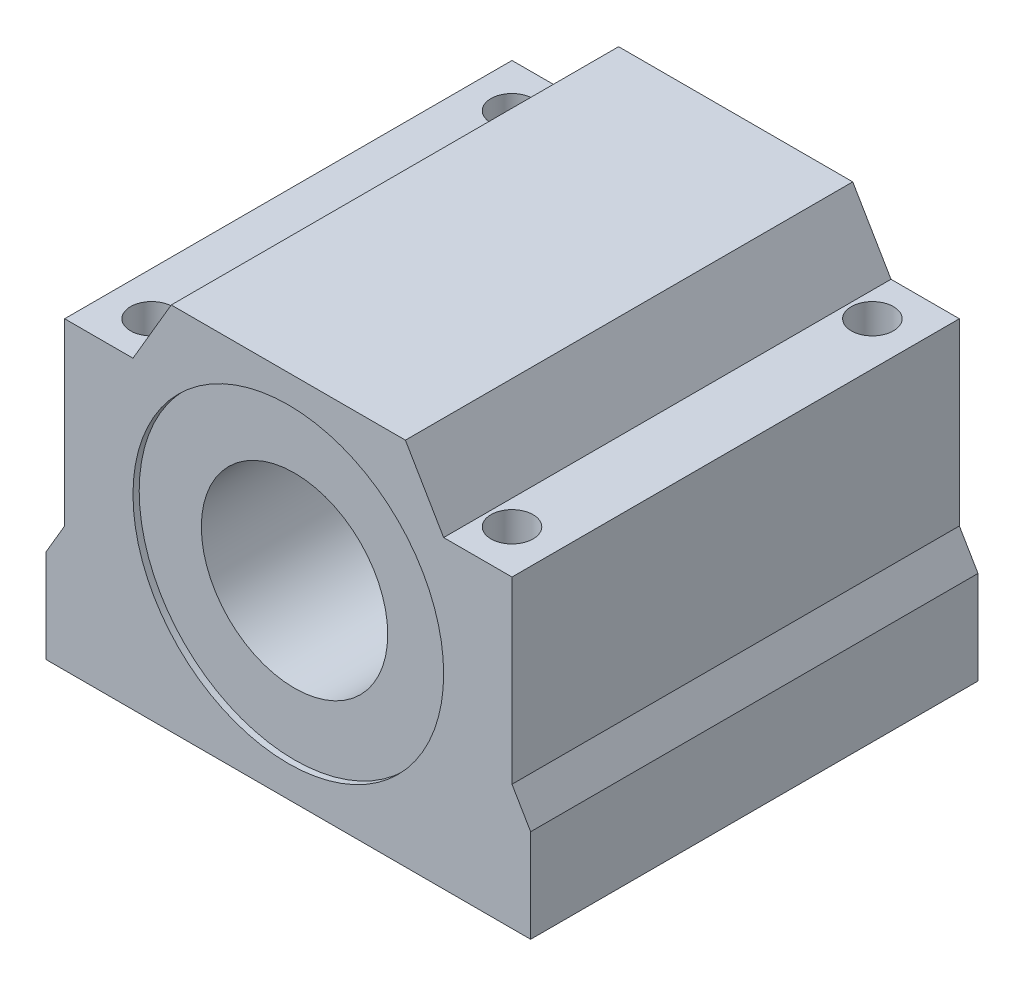
ISO-10303-21;
HEADER;
FILE_DESCRIPTION(('STEP AP214'),'2;1');
FILE_NAME('part.step','',(''),(''),'','','');
FILE_SCHEMA(('AUTOMOTIVE_DESIGN { 1 0 10303 214 1 1 1 1 }'));
ENDSEC;
DATA;
#1=APPLICATION_CONTEXT('core data for automotive mechanical design processes');
#2=APPLICATION_PROTOCOL_DEFINITION('international standard','automotive_design',2000,#1);
#3=PRODUCT_CONTEXT('',#1,'mechanical');
#4=PRODUCT('Part','Part','',(#3));
#5=PRODUCT_RELATED_PRODUCT_CATEGORY('part','',(#4));
#6=PRODUCT_DEFINITION_FORMATION('','',#4);
#7=PRODUCT_DEFINITION_CONTEXT('part definition',#1,'design');
#8=PRODUCT_DEFINITION('design','',#6,#7);
#9=PRODUCT_DEFINITION_SHAPE('','',#8);
#10=(LENGTH_UNIT() NAMED_UNIT(*) SI_UNIT(.MILLI.,.METRE.));
#11=(NAMED_UNIT(*) PLANE_ANGLE_UNIT() SI_UNIT($,.RADIAN.));
#12=(NAMED_UNIT(*) SI_UNIT($,.STERADIAN.) SOLID_ANGLE_UNIT());
#13=UNCERTAINTY_MEASURE_WITH_UNIT(LENGTH_MEASURE(1.E-05),#10,'distance_accuracy_value','');
#14=(GEOMETRIC_REPRESENTATION_CONTEXT(3) GLOBAL_UNCERTAINTY_ASSIGNED_CONTEXT((#13)) GLOBAL_UNIT_ASSIGNED_CONTEXT((#10,
#11,#12)) REPRESENTATION_CONTEXT('',''));
#15=CARTESIAN_POINT('',(0.,0.,0.));
#16=DIRECTION('',(0.,0.,1.));
#17=DIRECTION('',(1.,0.,0.));
#18=AXIS2_PLACEMENT_3D('',#15,#16,#17);
#19=CARTESIAN_POINT('',(0.,29.7500000000005,36.));
#20=DIRECTION('',(0.,0.,1.));
#21=DIRECTION('',(1.,0.,0.));
#22=AXIS2_PLACEMENT_3D('',#19,#20,#21);
#23=PLANE('',#22);
#24=CARTESIAN_POINT('',(0.,30.,36.));
#25=DIRECTION('',(0.,0.,-1.));
#26=DIRECTION('',(1.,0.,0.));
#27=AXIS2_PLACEMENT_3D('',#24,#25,#26);
#28=CIRCLE('',#27,25.);
#29=CARTESIAN_POINT('',(-25.,30.,36.));
#30=VERTEX_POINT('',#29);
#31=EDGE_CURVE('P0_E164',#30,#30,#28,.T.);
#32=ORIENTED_EDGE('',*,*,#31,.T.);
#33=EDGE_LOOP('',(#32));
#34=FACE_BOUND('',#33,.T.);
#35=DIRECTION('',(1.,0.,0.));
#36=VECTOR('',#35,1.);
#37=CARTESIAN_POINT('',(0.,0.,36.));
#38=LINE('',#37,#36);
#39=CARTESIAN_POINT('',(-39.,0.,36.));
#40=VERTEX_POINT('',#39);
#41=CARTESIAN_POINT('',(39.,0.,36.));
#42=VERTEX_POINT('',#41);
#43=EDGE_CURVE('P0_E11',#40,#42,#38,.T.);
#44=ORIENTED_EDGE('',*,*,#43,.T.);
#45=DIRECTION('',(0.,1.,0.));
#46=VECTOR('',#45,1.);
#47=CARTESIAN_POINT('',(39.,0.,36.));
#48=LINE('',#47,#46);
#49=CARTESIAN_POINT('',(39.,15.,36.));
#50=VERTEX_POINT('',#49);
#51=EDGE_CURVE('P0_E259',#42,#50,#48,.T.);
#52=ORIENTED_EDGE('',*,*,#51,.T.);
#53=DIRECTION('',(-0.505858736644665,0.862616333348879,0.));
#54=VECTOR('',#53,1.);
#55=CARTESIAN_POINT('',(36.,20.1157542858934,36.));
#56=LINE('',#55,#54);
#57=CARTESIAN_POINT('',(36.,20.1157542858934,36.));
#58=VERTEX_POINT('',#57);
#59=EDGE_CURVE('P0_E194',#50,#58,#56,.T.);
#60=ORIENTED_EDGE('',*,*,#59,.T.);
#61=DIRECTION('',(0.,1.,0.));
#62=VECTOR('',#61,1.);
#63=CARTESIAN_POINT('',(36.,20.1157542858934,36.));
#64=LINE('',#63,#62);
#65=CARTESIAN_POINT('',(36.,49.,36.));
#66=VERTEX_POINT('',#65);
#67=EDGE_CURVE('P0_E195',#58,#66,#64,.T.);
#68=ORIENTED_EDGE('',*,*,#67,.T.);
#69=DIRECTION('',(-1.,0.,0.));
#70=VECTOR('',#69,1.);
#71=CARTESIAN_POINT('',(36.,49.,36.));
#72=LINE('',#71,#70);
#73=CARTESIAN_POINT('',(25.,49.,36.));
#74=VERTEX_POINT('',#73);
#75=EDGE_CURVE('P0_E288',#66,#74,#72,.T.);
#76=ORIENTED_EDGE('',*,*,#75,.T.);
#77=DIRECTION('',(-0.505858736644659,0.862616333348882,0.));
#78=VECTOR('',#77,1.);
#79=CARTESIAN_POINT('',(18.8425502399788,59.5000000000011,36.));
#80=LINE('',#79,#78);
#81=CARTESIAN_POINT('',(18.8425502399788,59.5,36.));
#82=VERTEX_POINT('',#81);
#83=EDGE_CURVE('P0_E254',#74,#82,#80,.T.);
#84=ORIENTED_EDGE('',*,*,#83,.T.);
#85=DIRECTION('',(-1.,0.,0.));
#86=VECTOR('',#85,1.);
#87=CARTESIAN_POINT('',(0.,59.5,36.));
#88=LINE('',#87,#86);
#89=CARTESIAN_POINT('',(-18.8425502399788,59.5000000000009,36.));
#90=VERTEX_POINT('',#89);
#91=EDGE_CURVE('P0_E186',#82,#90,#88,.T.);
#92=ORIENTED_EDGE('',*,*,#91,.T.);
#93=DIRECTION('',(-0.505858736644664,-0.862616333348879,0.));
#94=VECTOR('',#93,1.);
#95=CARTESIAN_POINT('',(-25.,49.,36.));
#96=LINE('',#95,#94);
#97=CARTESIAN_POINT('',(-25.,49.,36.));
#98=VERTEX_POINT('',#97);
#99=EDGE_CURVE('P0_E241',#90,#98,#96,.T.);
#100=ORIENTED_EDGE('',*,*,#99,.T.);
#101=DIRECTION('',(-1.,0.,0.));
#102=VECTOR('',#101,1.);
#103=CARTESIAN_POINT('',(-36.,49.,36.));
#104=LINE('',#103,#102);
#105=CARTESIAN_POINT('',(-36.,49.,36.));
#106=VERTEX_POINT('',#105);
#107=EDGE_CURVE('P0_E263',#98,#106,#104,.T.);
#108=ORIENTED_EDGE('',*,*,#107,.T.);
#109=DIRECTION('',(0.,-1.,0.));
#110=VECTOR('',#109,1.);
#111=CARTESIAN_POINT('',(-36.,20.1157542858934,36.));
#112=LINE('',#111,#110);
#113=CARTESIAN_POINT('',(-36.,20.1157542858934,36.));
#114=VERTEX_POINT('',#113);
#115=EDGE_CURVE('P0_E205',#106,#114,#112,.T.);
#116=ORIENTED_EDGE('',*,*,#115,.T.);
#117=DIRECTION('',(-0.505858736644665,-0.862616333348879,0.));
#118=VECTOR('',#117,1.);
#119=CARTESIAN_POINT('',(-39.,15.,36.));
#120=LINE('',#119,#118);
#121=CARTESIAN_POINT('',(-39.,15.,36.));
#122=VERTEX_POINT('',#121);
#123=EDGE_CURVE('P0_E206',#114,#122,#120,.T.);
#124=ORIENTED_EDGE('',*,*,#123,.T.);
#125=DIRECTION('',(0.,-1.,0.));
#126=VECTOR('',#125,1.);
#127=CARTESIAN_POINT('',(-39.,0.,36.));
#128=LINE('',#127,#126);
#129=EDGE_CURVE('P0_E227',#122,#40,#128,.T.);
#130=ORIENTED_EDGE('',*,*,#129,.T.);
#131=EDGE_LOOP('',(#44,#52,#60,#68,#76,#84,#92,#100,#108,#116,#124,#130));
#132=FACE_BOUND('',#131,.T.);
#133=ADVANCED_FACE('P0_F16',(#34,#132),#23,.T.);
#134=CARTESIAN_POINT('',(-39.,0.,0.));
#135=DIRECTION('',(0.,-1.,0.));
#136=DIRECTION('',(0.,0.,-1.));
#137=AXIS2_PLACEMENT_3D('',#134,#135,#136);
#138=PLANE('',#137);
#139=CARTESIAN_POINT('',(-29.,0.,-29.));
#140=DIRECTION('',(0.,1.,0.));
#141=DIRECTION('',(0.,0.,-1.));
#142=AXIS2_PLACEMENT_3D('',#139,#140,#141);
#143=CIRCLE('',#142,3.38975);
#144=CARTESIAN_POINT('',(-29.,0.,-25.61025));
#145=VERTEX_POINT('',#144);
#146=EDGE_CURVE('P0_E301',#145,#145,#143,.T.);
#147=ORIENTED_EDGE('',*,*,#146,.T.);
#148=EDGE_LOOP('',(#147));
#149=FACE_BOUND('',#148,.T.);
#150=CARTESIAN_POINT('',(29.,0.,29.));
#151=DIRECTION('',(0.,1.,0.));
#152=DIRECTION('',(0.,0.,-1.));
#153=AXIS2_PLACEMENT_3D('',#150,#151,#152);
#154=CIRCLE('',#153,3.38975);
#155=CARTESIAN_POINT('',(29.,0.,32.38975));
#156=VERTEX_POINT('',#155);
#157=EDGE_CURVE('P0_E253',#156,#156,#154,.T.);
#158=ORIENTED_EDGE('',*,*,#157,.T.);
#159=EDGE_LOOP('',(#158));
#160=FACE_BOUND('',#159,.T.);
#161=CARTESIAN_POINT('',(-29.,0.,29.));
#162=DIRECTION('',(0.,1.,0.));
#163=DIRECTION('',(0.,0.,-1.));
#164=AXIS2_PLACEMENT_3D('',#161,#162,#163);
#165=CIRCLE('',#164,3.38975);
#166=CARTESIAN_POINT('',(-29.,0.,32.38975));
#167=VERTEX_POINT('',#166);
#168=EDGE_CURVE('P0_E280',#167,#167,#165,.T.);
#169=ORIENTED_EDGE('',*,*,#168,.T.);
#170=EDGE_LOOP('',(#169));
#171=FACE_BOUND('',#170,.T.);
#172=CARTESIAN_POINT('',(29.,0.,-29.));
#173=DIRECTION('',(0.,1.,0.));
#174=DIRECTION('',(0.,0.,-1.));
#175=AXIS2_PLACEMENT_3D('',#172,#173,#174);
#176=CIRCLE('',#175,3.38975);
#177=CARTESIAN_POINT('',(29.,0.,-25.61025));
#178=VERTEX_POINT('',#177);
#179=EDGE_CURVE('P0_E238',#178,#178,#176,.T.);
#180=ORIENTED_EDGE('',*,*,#179,.T.);
#181=EDGE_LOOP('',(#180));
#182=FACE_BOUND('',#181,.T.);
#183=DIRECTION('',(0.,0.,1.));
#184=VECTOR('',#183,1.);
#185=CARTESIAN_POINT('',(39.,0.,0.));
#186=LINE('',#185,#184);
#187=CARTESIAN_POINT('',(39.,0.,-36.));
#188=VERTEX_POINT('',#187);
#189=EDGE_CURVE('P0_E27',#188,#42,#186,.T.);
#190=ORIENTED_EDGE('',*,*,#189,.T.);
#191=ORIENTED_EDGE('',*,*,#43,.F.);
#192=DIRECTION('',(0.,0.,1.));
#193=VECTOR('',#192,1.);
#194=CARTESIAN_POINT('',(-39.,0.,0.));
#195=LINE('',#194,#193);
#196=CARTESIAN_POINT('',(-39.,0.,-36.));
#197=VERTEX_POINT('',#196);
#198=EDGE_CURVE('P0_E166',#197,#40,#195,.T.);
#199=ORIENTED_EDGE('',*,*,#198,.F.);
#200=DIRECTION('',(-1.,0.,0.));
#201=VECTOR('',#200,1.);
#202=CARTESIAN_POINT('',(0.,0.,-36.));
#203=LINE('',#202,#201);
#204=EDGE_CURVE('P0_E271',#188,#197,#203,.T.);
#205=ORIENTED_EDGE('',*,*,#204,.F.);
#206=EDGE_LOOP('',(#190,#191,#199,#205));
#207=FACE_BOUND('',#206,.T.);
#208=ADVANCED_FACE('P0_F359',(#149,#160,#171,#182,#207),#138,.T.);
#209=CARTESIAN_POINT('',(39.,0.,0.));
#210=DIRECTION('',(1.,0.,0.));
#211=DIRECTION('',(0.,1.,0.));
#212=AXIS2_PLACEMENT_3D('',#209,#210,#211);
#213=PLANE('',#212);
#214=DIRECTION('',(0.,0.,1.));
#215=VECTOR('',#214,1.);
#216=CARTESIAN_POINT('',(39.,15.,0.));
#217=LINE('',#216,#215);
#218=CARTESIAN_POINT('',(39.,15.,-36.));
#219=VERTEX_POINT('',#218);
#220=EDGE_CURVE('P0_E308',#219,#50,#217,.T.);
#221=ORIENTED_EDGE('',*,*,#220,.T.);
#222=ORIENTED_EDGE('',*,*,#51,.F.);
#223=ORIENTED_EDGE('',*,*,#189,.F.);
#224=DIRECTION('',(0.,-1.,0.));
#225=VECTOR('',#224,1.);
#226=CARTESIAN_POINT('',(39.,0.,-36.));
#227=LINE('',#226,#225);
#228=EDGE_CURVE('P0_E171',#219,#188,#227,.T.);
#229=ORIENTED_EDGE('',*,*,#228,.F.);
#230=EDGE_LOOP('',(#221,#222,#223,#229));
#231=FACE_BOUND('',#230,.T.);
#232=ADVANCED_FACE('P0_F365',(#231),#213,.T.);
#233=CARTESIAN_POINT('',(39.,15.,0.));
#234=DIRECTION('',(0.862616333348879,0.505858736644664,0.));
#235=DIRECTION('',(0.,0.,-1.));
#236=AXIS2_PLACEMENT_3D('',#233,#234,#235);
#237=PLANE('',#236);
#238=DIRECTION('',(0.,0.,1.));
#239=VECTOR('',#238,1.);
#240=CARTESIAN_POINT('',(36.,20.1157542858934,0.));
#241=LINE('',#240,#239);
#242=CARTESIAN_POINT('',(36.,20.1157542858934,-36.));
#243=VERTEX_POINT('',#242);
#244=EDGE_CURVE('P0_E191',#243,#58,#241,.T.);
#245=ORIENTED_EDGE('',*,*,#244,.T.);
#246=ORIENTED_EDGE('',*,*,#59,.F.);
#247=ORIENTED_EDGE('',*,*,#220,.F.);
#248=DIRECTION('',(0.505858736644665,-0.862616333348879,0.));
#249=VECTOR('',#248,1.);
#250=CARTESIAN_POINT('',(36.,20.1157542858934,-36.));
#251=LINE('',#250,#249);
#252=EDGE_CURVE('P0_E180',#243,#219,#251,.T.);
#253=ORIENTED_EDGE('',*,*,#252,.F.);
#254=EDGE_LOOP('',(#245,#246,#247,#253));
#255=FACE_BOUND('',#254,.T.);
#256=ADVANCED_FACE('P0_F352',(#255),#237,.T.);
#257=CARTESIAN_POINT('',(36.,20.1157542858934,0.));
#258=DIRECTION('',(1.,0.,0.));
#259=DIRECTION('',(0.,-1.,0.));
#260=AXIS2_PLACEMENT_3D('',#257,#258,#259);
#261=PLANE('',#260);
#262=DIRECTION('',(0.,0.,1.));
#263=VECTOR('',#262,1.);
#264=CARTESIAN_POINT('',(36.,49.,0.));
#265=LINE('',#264,#263);
#266=CARTESIAN_POINT('',(36.,49.,-36.));
#267=VERTEX_POINT('',#266);
#268=EDGE_CURVE('P0_E20',#267,#66,#265,.T.);
#269=ORIENTED_EDGE('',*,*,#268,.T.);
#270=ORIENTED_EDGE('',*,*,#67,.F.);
#271=ORIENTED_EDGE('',*,*,#244,.F.);
#272=DIRECTION('',(0.,-1.,0.));
#273=VECTOR('',#272,1.);
#274=CARTESIAN_POINT('',(36.,20.1157542858934,-36.));
#275=LINE('',#274,#273);
#276=EDGE_CURVE('P0_E243',#267,#243,#275,.T.);
#277=ORIENTED_EDGE('',*,*,#276,.F.);
#278=EDGE_LOOP('',(#269,#270,#271,#277));
#279=FACE_BOUND('',#278,.T.);
#280=ADVANCED_FACE('P0_F343',(#279),#261,.T.);
#281=CARTESIAN_POINT('',(36.,49.,0.));
#282=DIRECTION('',(0.,1.,0.));
#283=DIRECTION('',(1.,0.,0.));
#284=AXIS2_PLACEMENT_3D('',#281,#282,#283);
#285=PLANE('',#284);
#286=CARTESIAN_POINT('',(29.,49.,29.));
#287=DIRECTION('',(0.,-1.,0.));
#288=DIRECTION('',(0.,0.,-1.));
#289=AXIS2_PLACEMENT_3D('',#286,#287,#288);
#290=CIRCLE('',#289,3.38975);
#291=CARTESIAN_POINT('',(29.,49.,32.38975));
#292=VERTEX_POINT('',#291);
#293=EDGE_CURVE('P0_E252',#292,#292,#290,.T.);
#294=ORIENTED_EDGE('',*,*,#293,.T.);
#295=EDGE_LOOP('',(#294));
#296=FACE_BOUND('',#295,.T.);
#297=CARTESIAN_POINT('',(29.,49.,-29.));
#298=DIRECTION('',(0.,-1.,0.));
#299=DIRECTION('',(0.,0.,-1.));
#300=AXIS2_PLACEMENT_3D('',#297,#298,#299);
#301=CIRCLE('',#300,3.38975);
#302=CARTESIAN_POINT('',(29.,49.,-25.61025));
#303=VERTEX_POINT('',#302);
#304=EDGE_CURVE('P0_E237',#303,#303,#301,.T.);
#305=ORIENTED_EDGE('',*,*,#304,.T.);
#306=EDGE_LOOP('',(#305));
#307=FACE_BOUND('',#306,.T.);
#308=DIRECTION('',(0.,0.,1.));
#309=VECTOR('',#308,1.);
#310=CARTESIAN_POINT('',(25.,49.,0.));
#311=LINE('',#310,#309);
#312=CARTESIAN_POINT('',(25.,49.,-36.));
#313=VERTEX_POINT('',#312);
#314=EDGE_CURVE('P0_E115',#313,#74,#311,.T.);
#315=ORIENTED_EDGE('',*,*,#314,.T.);
#316=ORIENTED_EDGE('',*,*,#75,.F.);
#317=ORIENTED_EDGE('',*,*,#268,.F.);
#318=DIRECTION('',(1.,0.,0.));
#319=VECTOR('',#318,1.);
#320=CARTESIAN_POINT('',(36.,49.,-36.));
#321=LINE('',#320,#319);
#322=EDGE_CURVE('P0_E246',#313,#267,#321,.T.);
#323=ORIENTED_EDGE('',*,*,#322,.F.);
#324=EDGE_LOOP('',(#315,#316,#317,#323));
#325=FACE_BOUND('',#324,.T.);
#326=ADVANCED_FACE('P0_F341',(#296,#307,#325),#285,.T.);
#327=CARTESIAN_POINT('',(25.,49.,0.));
#328=DIRECTION('',(0.862616333348882,0.505858736644659,0.));
#329=DIRECTION('',(0.,0.,-1.));
#330=AXIS2_PLACEMENT_3D('',#327,#328,#329);
#331=PLANE('',#330);
#332=DIRECTION('',(0.,0.,1.));
#333=VECTOR('',#332,1.);
#334=CARTESIAN_POINT('',(18.8425502399788,59.5,0.));
#335=LINE('',#334,#333);
#336=CARTESIAN_POINT('',(18.8425502399788,59.5,-36.));
#337=VERTEX_POINT('',#336);
#338=EDGE_CURVE('P0_E189',#337,#82,#335,.T.);
#339=ORIENTED_EDGE('',*,*,#338,.T.);
#340=ORIENTED_EDGE('',*,*,#83,.F.);
#341=ORIENTED_EDGE('',*,*,#314,.F.);
#342=DIRECTION('',(0.505858736644659,-0.862616333348882,0.));
#343=VECTOR('',#342,1.);
#344=CARTESIAN_POINT('',(18.8425502399788,59.5000000000011,-36.));
#345=LINE('',#344,#343);
#346=EDGE_CURVE('P0_E184',#337,#313,#345,.T.);
#347=ORIENTED_EDGE('',*,*,#346,.F.);
#348=EDGE_LOOP('',(#339,#340,#341,#347));
#349=FACE_BOUND('',#348,.T.);
#350=ADVANCED_FACE('P0_F330',(#349),#331,.T.);
#351=CARTESIAN_POINT('',(18.8425502399788,59.5,0.));
#352=DIRECTION('',(0.,1.,0.));
#353=DIRECTION('',(1.,0.,0.));
#354=AXIS2_PLACEMENT_3D('',#351,#352,#353);
#355=PLANE('',#354);
#356=DIRECTION('',(0.,0.,1.));
#357=VECTOR('',#356,1.);
#358=CARTESIAN_POINT('',(-18.8425502399788,59.5000000000009,0.));
#359=LINE('',#358,#357);
#360=CARTESIAN_POINT('',(-18.8425502399788,59.5000000000009,-36.));
#361=VERTEX_POINT('',#360);
#362=EDGE_CURVE('P0_E190',#361,#90,#359,.T.);
#363=ORIENTED_EDGE('',*,*,#362,.T.);
#364=ORIENTED_EDGE('',*,*,#91,.F.);
#365=ORIENTED_EDGE('',*,*,#338,.F.);
#366=DIRECTION('',(1.,0.,0.));
#367=VECTOR('',#366,1.);
#368=CARTESIAN_POINT('',(0.,59.5,-36.));
#369=LINE('',#368,#367);
#370=EDGE_CURVE('P0_E292',#361,#337,#369,.T.);
#371=ORIENTED_EDGE('',*,*,#370,.F.);
#372=EDGE_LOOP('',(#363,#364,#365,#371));
#373=FACE_BOUND('',#372,.T.);
#374=ADVANCED_FACE('P0_F335',(#373),#355,.T.);
#375=CARTESIAN_POINT('',(-18.8425502399788,59.5000000000009,0.));
#376=DIRECTION('',(-0.862616333348879,0.505858736644664,0.));
#377=DIRECTION('',(0.,0.,1.));
#378=AXIS2_PLACEMENT_3D('',#375,#376,#377);
#379=PLANE('',#378);
#380=DIRECTION('',(0.,0.,1.));
#381=VECTOR('',#380,1.);
#382=CARTESIAN_POINT('',(-25.,49.,0.));
#383=LINE('',#382,#381);
#384=CARTESIAN_POINT('',(-25.,49.,-36.));
#385=VERTEX_POINT('',#384);
#386=EDGE_CURVE('P0_E264',#385,#98,#383,.T.);
#387=ORIENTED_EDGE('',*,*,#386,.T.);
#388=ORIENTED_EDGE('',*,*,#99,.F.);
#389=ORIENTED_EDGE('',*,*,#362,.F.);
#390=DIRECTION('',(0.505858736644664,0.862616333348879,0.));
#391=VECTOR('',#390,1.);
#392=CARTESIAN_POINT('',(-25.,49.,-36.));
#393=LINE('',#392,#391);
#394=EDGE_CURVE('P0_E231',#385,#361,#393,.T.);
#395=ORIENTED_EDGE('',*,*,#394,.F.);
#396=EDGE_LOOP('',(#387,#388,#389,#395));
#397=FACE_BOUND('',#396,.T.);
#398=ADVANCED_FACE('P0_F381',(#397),#379,.T.);
#399=CARTESIAN_POINT('',(-25.,49.,0.));
#400=DIRECTION('',(0.,1.,0.));
#401=DIRECTION('',(1.,0.,0.));
#402=AXIS2_PLACEMENT_3D('',#399,#400,#401);
#403=PLANE('',#402);
#404=CARTESIAN_POINT('',(-29.,49.,-29.));
#405=DIRECTION('',(0.,-1.,0.));
#406=DIRECTION('',(0.,0.,-1.));
#407=AXIS2_PLACEMENT_3D('',#404,#405,#406);
#408=CIRCLE('',#407,3.38975);
#409=CARTESIAN_POINT('',(-29.,49.,-25.61025));
#410=VERTEX_POINT('',#409);
#411=EDGE_CURVE('P0_E300',#410,#410,#408,.T.);
#412=ORIENTED_EDGE('',*,*,#411,.T.);
#413=EDGE_LOOP('',(#412));
#414=FACE_BOUND('',#413,.T.);
#415=CARTESIAN_POINT('',(-29.,49.,29.));
#416=DIRECTION('',(0.,-1.,0.));
#417=DIRECTION('',(0.,0.,-1.));
#418=AXIS2_PLACEMENT_3D('',#415,#416,#417);
#419=CIRCLE('',#418,3.38975);
#420=CARTESIAN_POINT('',(-29.,49.,32.38975));
#421=VERTEX_POINT('',#420);
#422=EDGE_CURVE('P0_E279',#421,#421,#419,.T.);
#423=ORIENTED_EDGE('',*,*,#422,.T.);
#424=EDGE_LOOP('',(#423));
#425=FACE_BOUND('',#424,.T.);
#426=DIRECTION('',(0.,0.,1.));
#427=VECTOR('',#426,1.);
#428=CARTESIAN_POINT('',(-36.,49.,0.));
#429=LINE('',#428,#427);
#430=CARTESIAN_POINT('',(-36.,49.,-36.));
#431=VERTEX_POINT('',#430);
#432=EDGE_CURVE('P0_E218',#431,#106,#429,.T.);
#433=ORIENTED_EDGE('',*,*,#432,.T.);
#434=ORIENTED_EDGE('',*,*,#107,.F.);
#435=ORIENTED_EDGE('',*,*,#386,.F.);
#436=DIRECTION('',(1.,0.,0.));
#437=VECTOR('',#436,1.);
#438=CARTESIAN_POINT('',(-36.,49.,-36.));
#439=LINE('',#438,#437);
#440=EDGE_CURVE('P0_E514',#431,#385,#439,.T.);
#441=ORIENTED_EDGE('',*,*,#440,.F.);
#442=EDGE_LOOP('',(#433,#434,#435,#441));
#443=FACE_BOUND('',#442,.T.);
#444=ADVANCED_FACE('P0_F372',(#414,#425,#443),#403,.T.);
#445=CARTESIAN_POINT('',(-36.,49.,0.));
#446=DIRECTION('',(-1.,0.,0.));
#447=DIRECTION('',(0.,1.,0.));
#448=AXIS2_PLACEMENT_3D('',#445,#446,#447);
#449=PLANE('',#448);
#450=DIRECTION('',(0.,0.,1.));
#451=VECTOR('',#450,1.);
#452=CARTESIAN_POINT('',(-36.,20.1157542858934,0.));
#453=LINE('',#452,#451);
#454=CARTESIAN_POINT('',(-36.,20.1157542858934,-36.));
#455=VERTEX_POINT('',#454);
#456=EDGE_CURVE('P0_E202',#455,#114,#453,.T.);
#457=ORIENTED_EDGE('',*,*,#456,.T.);
#458=ORIENTED_EDGE('',*,*,#115,.F.);
#459=ORIENTED_EDGE('',*,*,#432,.F.);
#460=DIRECTION('',(0.,1.,0.));
#461=VECTOR('',#460,1.);
#462=CARTESIAN_POINT('',(-36.,20.1157542858934,-36.));
#463=LINE('',#462,#461);
#464=EDGE_CURVE('P0_E200',#455,#431,#463,.T.);
#465=ORIENTED_EDGE('',*,*,#464,.F.);
#466=EDGE_LOOP('',(#457,#458,#459,#465));
#467=FACE_BOUND('',#466,.T.);
#468=ADVANCED_FACE('P0_F368',(#467),#449,.T.);
#469=CARTESIAN_POINT('',(-36.,20.1157542858934,0.));
#470=DIRECTION('',(-0.862616333348879,0.505858736644665,0.));
#471=DIRECTION('',(0.,0.,1.));
#472=AXIS2_PLACEMENT_3D('',#469,#470,#471);
#473=PLANE('',#472);
#474=DIRECTION('',(0.,0.,1.));
#475=VECTOR('',#474,1.);
#476=CARTESIAN_POINT('',(-39.,15.,0.));
#477=LINE('',#476,#475);
#478=CARTESIAN_POINT('',(-39.,15.,-36.));
#479=VERTEX_POINT('',#478);
#480=EDGE_CURVE('P0_E221',#479,#122,#477,.T.);
#481=ORIENTED_EDGE('',*,*,#480,.T.);
#482=ORIENTED_EDGE('',*,*,#123,.F.);
#483=ORIENTED_EDGE('',*,*,#456,.F.);
#484=DIRECTION('',(0.505858736644665,0.862616333348879,0.));
#485=VECTOR('',#484,1.);
#486=CARTESIAN_POINT('',(-39.,15.,-36.));
#487=LINE('',#486,#485);
#488=EDGE_CURVE('P0_E197',#479,#455,#487,.T.);
#489=ORIENTED_EDGE('',*,*,#488,.F.);
#490=EDGE_LOOP('',(#481,#482,#483,#489));
#491=FACE_BOUND('',#490,.T.);
#492=ADVANCED_FACE('P0_F371',(#491),#473,.T.);
#493=CARTESIAN_POINT('',(-39.,15.,0.));
#494=DIRECTION('',(-1.,0.,0.));
#495=DIRECTION('',(0.,0.,1.));
#496=AXIS2_PLACEMENT_3D('',#493,#494,#495);
#497=PLANE('',#496);
#498=ORIENTED_EDGE('',*,*,#198,.T.);
#499=ORIENTED_EDGE('',*,*,#129,.F.);
#500=ORIENTED_EDGE('',*,*,#480,.F.);
#501=DIRECTION('',(0.,1.,0.));
#502=VECTOR('',#501,1.);
#503=CARTESIAN_POINT('',(-39.,0.,-36.));
#504=LINE('',#503,#502);
#505=EDGE_CURVE('P0_E201',#197,#479,#504,.T.);
#506=ORIENTED_EDGE('',*,*,#505,.F.);
#507=EDGE_LOOP('',(#498,#499,#500,#506));
#508=FACE_BOUND('',#507,.T.);
#509=ADVANCED_FACE('P0_F389',(#508),#497,.T.);
#510=CARTESIAN_POINT('',(0.,30.,0.));
#511=DIRECTION('',(0.,0.,1.));
#512=DIRECTION('',(1.,0.,0.));
#513=AXIS2_PLACEMENT_3D('',#510,#511,#512);
#514=CYLINDRICAL_SURFACE('',#513,25.);
#515=ORIENTED_EDGE('',*,*,#31,.F.);
#516=DIRECTION('',(0.,0.,-1.));
#517=VECTOR('',#516,1.);
#518=CARTESIAN_POINT('',(-25.,30.,0.));
#519=LINE('',#518,#517);
#520=CARTESIAN_POINT('',(-25.,30.,-36.));
#521=VERTEX_POINT('',#520);
#522=EDGE_CURVE('P0_E159',#30,#521,#519,.T.);
#523=ORIENTED_EDGE('',*,*,#522,.T.);
#524=CARTESIAN_POINT('',(0.,30.,-36.));
#525=DIRECTION('',(0.,0.,1.));
#526=DIRECTION('',(1.,0.,0.));
#527=AXIS2_PLACEMENT_3D('',#524,#525,#526);
#528=CIRCLE('',#527,25.);
#529=EDGE_CURVE('P0_E162',#521,#521,#528,.T.);
#530=ORIENTED_EDGE('',*,*,#529,.F.);
#531=ORIENTED_EDGE('',*,*,#522,.F.);
#532=EDGE_LOOP('',(#515,#523,#530,#531));
#533=FACE_BOUND('',#532,.T.);
#534=ADVANCED_FACE('P0_F161',(#533),#514,.F.);
#535=CARTESIAN_POINT('',(0.,29.7500000000005,-36.));
#536=DIRECTION('',(0.,0.,1.));
#537=DIRECTION('',(1.,0.,0.));
#538=AXIS2_PLACEMENT_3D('',#535,#536,#537);
#539=PLANE('',#538);
#540=ORIENTED_EDGE('',*,*,#529,.T.);
#541=EDGE_LOOP('',(#540));
#542=FACE_BOUND('',#541,.T.);
#543=ORIENTED_EDGE('',*,*,#204,.T.);
#544=ORIENTED_EDGE('',*,*,#505,.T.);
#545=ORIENTED_EDGE('',*,*,#488,.T.);
#546=ORIENTED_EDGE('',*,*,#464,.T.);
#547=ORIENTED_EDGE('',*,*,#440,.T.);
#548=ORIENTED_EDGE('',*,*,#394,.T.);
#549=ORIENTED_EDGE('',*,*,#370,.T.);
#550=ORIENTED_EDGE('',*,*,#346,.T.);
#551=ORIENTED_EDGE('',*,*,#322,.T.);
#552=ORIENTED_EDGE('',*,*,#276,.T.);
#553=ORIENTED_EDGE('',*,*,#252,.T.);
#554=ORIENTED_EDGE('',*,*,#228,.T.);
#555=EDGE_LOOP('',(#543,#544,#545,#546,#547,#548,#549,#550,#551,#552,#553,#554));
#556=FACE_BOUND('',#555,.T.);
#557=ADVANCED_FACE('P0_F18',(#542,#556),#539,.F.);
#558=CARTESIAN_POINT('',(-29.,26.95,-29.));
#559=DIRECTION('',(0.,1.,0.));
#560=DIRECTION('',(0.,0.,-1.));
#561=AXIS2_PLACEMENT_3D('',#558,#559,#560);
#562=CYLINDRICAL_SURFACE('',#561,3.38975);
#563=ORIENTED_EDGE('',*,*,#146,.F.);
#564=DIRECTION('',(0.,1.,0.));
#565=VECTOR('',#564,1.);
#566=CARTESIAN_POINT('',(-29.,26.95,-25.61025));
#567=LINE('',#566,#565);
#568=EDGE_CURVE('P0_E296',#145,#410,#567,.T.);
#569=ORIENTED_EDGE('',*,*,#568,.T.);
#570=ORIENTED_EDGE('',*,*,#411,.F.);
#571=ORIENTED_EDGE('',*,*,#568,.F.);
#572=EDGE_LOOP('',(#563,#569,#570,#571));
#573=FACE_BOUND('',#572,.T.);
#574=ADVANCED_FACE('P0_F377',(#573),#562,.F.);
#575=CARTESIAN_POINT('',(29.,26.95,29.));
#576=DIRECTION('',(0.,1.,0.));
#577=DIRECTION('',(0.,0.,-1.));
#578=AXIS2_PLACEMENT_3D('',#575,#576,#577);
#579=CYLINDRICAL_SURFACE('',#578,3.38975);
#580=ORIENTED_EDGE('',*,*,#157,.F.);
#581=DIRECTION('',(0.,1.,0.));
#582=VECTOR('',#581,1.);
#583=CARTESIAN_POINT('',(29.,26.95,32.38975));
#584=LINE('',#583,#582);
#585=EDGE_CURVE('P0_E248',#156,#292,#584,.T.);
#586=ORIENTED_EDGE('',*,*,#585,.T.);
#587=ORIENTED_EDGE('',*,*,#293,.F.);
#588=ORIENTED_EDGE('',*,*,#585,.F.);
#589=EDGE_LOOP('',(#580,#586,#587,#588));
#590=FACE_BOUND('',#589,.T.);
#591=ADVANCED_FACE('P0_F373',(#590),#579,.F.);
#592=CARTESIAN_POINT('',(-29.,26.95,29.));
#593=DIRECTION('',(0.,1.,0.));
#594=DIRECTION('',(0.,0.,-1.));
#595=AXIS2_PLACEMENT_3D('',#592,#593,#594);
#596=CYLINDRICAL_SURFACE('',#595,3.38975);
#597=ORIENTED_EDGE('',*,*,#168,.F.);
#598=DIRECTION('',(0.,1.,0.));
#599=VECTOR('',#598,1.);
#600=CARTESIAN_POINT('',(-29.,26.95,32.38975));
#601=LINE('',#600,#599);
#602=EDGE_CURVE('P0_E275',#167,#421,#601,.T.);
#603=ORIENTED_EDGE('',*,*,#602,.T.);
#604=ORIENTED_EDGE('',*,*,#422,.F.);
#605=ORIENTED_EDGE('',*,*,#602,.F.);
#606=EDGE_LOOP('',(#597,#603,#604,#605));
#607=FACE_BOUND('',#606,.T.);
#608=ADVANCED_FACE('P0_F376',(#607),#596,.F.);
#609=CARTESIAN_POINT('',(29.,26.95,-29.));
#610=DIRECTION('',(0.,1.,0.));
#611=DIRECTION('',(0.,0.,-1.));
#612=AXIS2_PLACEMENT_3D('',#609,#610,#611);
#613=CYLINDRICAL_SURFACE('',#612,3.38975);
#614=ORIENTED_EDGE('',*,*,#179,.F.);
#615=DIRECTION('',(0.,1.,0.));
#616=VECTOR('',#615,1.);
#617=CARTESIAN_POINT('',(29.,26.95,-25.61025));
#618=LINE('',#617,#616);
#619=EDGE_CURVE('P0_E233',#178,#303,#618,.T.);
#620=ORIENTED_EDGE('',*,*,#619,.T.);
#621=ORIENTED_EDGE('',*,*,#304,.F.);
#622=ORIENTED_EDGE('',*,*,#619,.F.);
#623=EDGE_LOOP('',(#614,#620,#621,#622));
#624=FACE_BOUND('',#623,.T.);
#625=ADVANCED_FACE('P0_F382',(#624),#613,.F.);
#626=CLOSED_SHELL('',(#133,#208,#232,#256,#280,#326,#350,#374,#398,#444,#468,#492,#509,#534,
#557,#574,#591,#608,#625));
#627=MANIFOLD_SOLID_BREP('P0_B1',#626);
#628=CARTESIAN_POINT('',(0.,30.,35.));
#629=DIRECTION('',(0.,0.,1.));
#630=DIRECTION('',(1.,0.,0.));
#631=AXIS2_PLACEMENT_3D('',#628,#629,#630);
#632=PLANE('',#631);
#633=CARTESIAN_POINT('',(0.,30.,35.));
#634=DIRECTION('',(0.,0.,-1.));
#635=DIRECTION('',(1.,0.,0.));
#636=AXIS2_PLACEMENT_3D('',#633,#634,#635);
#637=CIRCLE('',#636,15.);
#638=CARTESIAN_POINT('',(-15.,30.,35.));
#639=VERTEX_POINT('',#638);
#640=EDGE_CURVE('P1_E56',#639,#639,#637,.T.);
#641=ORIENTED_EDGE('',*,*,#640,.T.);
#642=EDGE_LOOP('',(#641));
#643=FACE_BOUND('',#642,.T.);
#644=CARTESIAN_POINT('',(0.,30.,35.));
#645=DIRECTION('',(0.,0.,1.));
#646=DIRECTION('',(1.,0.,0.));
#647=AXIS2_PLACEMENT_3D('',#644,#645,#646);
#648=CIRCLE('',#647,25.);
#649=CARTESIAN_POINT('',(-25.,30.,35.));
#650=VERTEX_POINT('',#649);
#651=EDGE_CURVE('P1_E27',#650,#650,#648,.T.);
#652=ORIENTED_EDGE('',*,*,#651,.T.);
#653=EDGE_LOOP('',(#652));
#654=FACE_BOUND('',#653,.T.);
#655=ADVANCED_FACE('P1_F16',(#643,#654),#632,.T.);
#656=CARTESIAN_POINT('',(0.,30.,0.));
#657=DIRECTION('',(0.,0.,1.));
#658=DIRECTION('',(1.,0.,0.));
#659=AXIS2_PLACEMENT_3D('',#656,#657,#658);
#660=CYLINDRICAL_SURFACE('',#659,25.);
#661=ORIENTED_EDGE('',*,*,#651,.F.);
#662=DIRECTION('',(0.,0.,-1.));
#663=VECTOR('',#662,1.);
#664=CARTESIAN_POINT('',(-25.,30.,0.));
#665=LINE('',#664,#663);
#666=CARTESIAN_POINT('',(-25.,30.,-35.));
#667=VERTEX_POINT('',#666);
#668=EDGE_CURVE('P1_E11',#650,#667,#665,.T.);
#669=ORIENTED_EDGE('',*,*,#668,.T.);
#670=CARTESIAN_POINT('',(0.,30.,-35.));
#671=DIRECTION('',(0.,0.,-1.));
#672=DIRECTION('',(1.,0.,0.));
#673=AXIS2_PLACEMENT_3D('',#670,#671,#672);
#674=CIRCLE('',#673,25.);
#675=EDGE_CURVE('P1_E63',#667,#667,#674,.T.);
#676=ORIENTED_EDGE('',*,*,#675,.F.);
#677=ORIENTED_EDGE('',*,*,#668,.F.);
#678=EDGE_LOOP('',(#661,#669,#676,#677));
#679=FACE_BOUND('',#678,.T.);
#680=ADVANCED_FACE('P1_F77',(#679),#660,.T.);
#681=CARTESIAN_POINT('',(0.,30.,0.));
#682=DIRECTION('',(0.,0.,1.));
#683=DIRECTION('',(1.,0.,0.));
#684=AXIS2_PLACEMENT_3D('',#681,#682,#683);
#685=CYLINDRICAL_SURFACE('',#684,15.);
#686=ORIENTED_EDGE('',*,*,#640,.F.);
#687=DIRECTION('',(0.,0.,-1.));
#688=VECTOR('',#687,1.);
#689=CARTESIAN_POINT('',(-15.,30.,0.));
#690=LINE('',#689,#688);
#691=CARTESIAN_POINT('',(-15.,30.,-35.));
#692=VERTEX_POINT('',#691);
#693=EDGE_CURVE('P1_E53',#639,#692,#690,.T.);
#694=ORIENTED_EDGE('',*,*,#693,.T.);
#695=CARTESIAN_POINT('',(0.,30.,-35.));
#696=DIRECTION('',(0.,0.,1.));
#697=DIRECTION('',(1.,0.,0.));
#698=AXIS2_PLACEMENT_3D('',#695,#696,#697);
#699=CIRCLE('',#698,15.);
#700=EDGE_CURVE('P1_E20',#692,#692,#699,.T.);
#701=ORIENTED_EDGE('',*,*,#700,.F.);
#702=ORIENTED_EDGE('',*,*,#693,.F.);
#703=EDGE_LOOP('',(#686,#694,#701,#702));
#704=FACE_BOUND('',#703,.T.);
#705=ADVANCED_FACE('P1_F18',(#704),#685,.F.);
#706=CARTESIAN_POINT('',(0.,30.,-35.));
#707=DIRECTION('',(0.,0.,1.));
#708=DIRECTION('',(1.,0.,0.));
#709=AXIS2_PLACEMENT_3D('',#706,#707,#708);
#710=PLANE('',#709);
#711=ORIENTED_EDGE('',*,*,#700,.T.);
#712=EDGE_LOOP('',(#711));
#713=FACE_BOUND('',#712,.T.);
#714=ORIENTED_EDGE('',*,*,#675,.T.);
#715=EDGE_LOOP('',(#714));
#716=FACE_BOUND('',#715,.T.);
#717=ADVANCED_FACE('P1_F60',(#713,#716),#710,.F.);
#718=CLOSED_SHELL('',(#655,#680,#705,#717));
#719=MANIFOLD_SOLID_BREP('P1_B1',#718);
#720=ADVANCED_BREP_SHAPE_REPRESENTATION('',(#18,#627,#719),#14);
#721=SHAPE_DEFINITION_REPRESENTATION(#9,#720);
ENDSEC;
END-ISO-10303-21;
